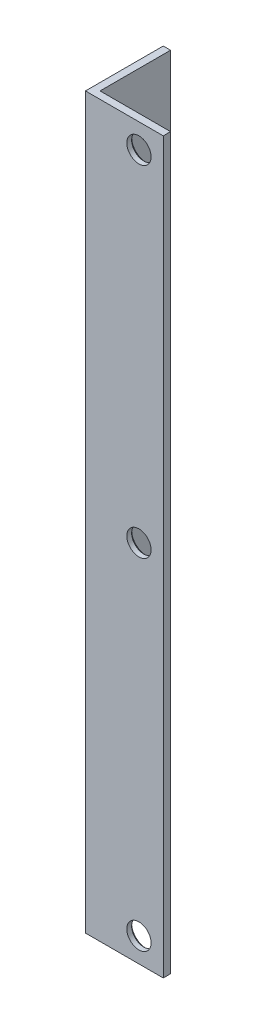
ISO-10303-21;
HEADER;
FILE_DESCRIPTION(('STEP AP214'),'2;1');
FILE_NAME('part.step','',(''),(''),'','','');
FILE_SCHEMA(('AUTOMOTIVE_DESIGN { 1 0 10303 214 1 1 1 1 }'));
ENDSEC;
DATA;
#1=APPLICATION_CONTEXT('core data for automotive mechanical design processes');
#2=APPLICATION_PROTOCOL_DEFINITION('international standard','automotive_design',2000,#1);
#3=PRODUCT_CONTEXT('',#1,'mechanical');
#4=PRODUCT('Part','Part','',(#3));
#5=PRODUCT_RELATED_PRODUCT_CATEGORY('part','',(#4));
#6=PRODUCT_DEFINITION_FORMATION('','',#4);
#7=PRODUCT_DEFINITION_CONTEXT('part definition',#1,'design');
#8=PRODUCT_DEFINITION('design','',#6,#7);
#9=PRODUCT_DEFINITION_SHAPE('','',#8);
#10=(LENGTH_UNIT() NAMED_UNIT(*) SI_UNIT(.MILLI.,.METRE.));
#11=(NAMED_UNIT(*) PLANE_ANGLE_UNIT() SI_UNIT($,.RADIAN.));
#12=(NAMED_UNIT(*) SI_UNIT($,.STERADIAN.) SOLID_ANGLE_UNIT());
#13=UNCERTAINTY_MEASURE_WITH_UNIT(LENGTH_MEASURE(1.E-05),#10,'distance_accuracy_value','');
#14=(GEOMETRIC_REPRESENTATION_CONTEXT(3) GLOBAL_UNCERTAINTY_ASSIGNED_CONTEXT((#13)) GLOBAL_UNIT_ASSIGNED_CONTEXT((#10,
#11,#12)) REPRESENTATION_CONTEXT('',''));
#15=CARTESIAN_POINT('',(0.,0.,0.));
#16=DIRECTION('',(0.,0.,1.));
#17=DIRECTION('',(1.,0.,0.));
#18=AXIS2_PLACEMENT_3D('',#15,#16,#17);
#19=CARTESIAN_POINT('',(0.,300.,0.));
#20=DIRECTION('',(0.,0.,-1.));
#21=DIRECTION('',(-1.,0.,0.));
#22=AXIS2_PLACEMENT_3D('',#19,#20,#21);
#23=PLANE('',#22);
#24=CARTESIAN_POINT('',(22.,10.,0.));
#25=DIRECTION('',(0.,0.,1.));
#26=DIRECTION('',(1.,0.,0.));
#27=AXIS2_PLACEMENT_3D('',#24,#25,#26);
#28=CIRCLE('',#27,5.);
#29=CARTESIAN_POINT('',(27.,10.,0.));
#30=VERTEX_POINT('',#29);
#31=EDGE_CURVE('E123',#30,#30,#28,.T.);
#32=ORIENTED_EDGE('',*,*,#31,.F.);
#33=EDGE_LOOP('',(#32));
#34=FACE_BOUND('',#33,.T.);
#35=CARTESIAN_POINT('',(21.9999999999995,150.,0.));
#36=DIRECTION('',(0.,0.,1.));
#37=DIRECTION('',(1.,0.,0.));
#38=AXIS2_PLACEMENT_3D('',#35,#36,#37);
#39=CIRCLE('',#38,5.);
#40=CARTESIAN_POINT('',(26.9999999999995,150.,0.));
#41=VERTEX_POINT('',#40);
#42=EDGE_CURVE('E212',#41,#41,#39,.T.);
#43=ORIENTED_EDGE('',*,*,#42,.F.);
#44=EDGE_LOOP('',(#43));
#45=FACE_BOUND('',#44,.T.);
#46=CARTESIAN_POINT('',(21.999999999999,290.,0.));
#47=DIRECTION('',(0.,0.,1.));
#48=DIRECTION('',(1.,0.,0.));
#49=AXIS2_PLACEMENT_3D('',#46,#47,#48);
#50=CIRCLE('',#49,5.);
#51=CARTESIAN_POINT('',(26.999999999999,290.,0.));
#52=VERTEX_POINT('',#51);
#53=EDGE_CURVE('E215',#52,#52,#50,.T.);
#54=ORIENTED_EDGE('',*,*,#53,.F.);
#55=EDGE_LOOP('',(#54));
#56=FACE_BOUND('',#55,.T.);
#57=DIRECTION('',(1.,0.,0.));
#58=VECTOR('',#57,1.);
#59=CARTESIAN_POINT('',(0.,0.,0.));
#60=LINE('',#59,#58);
#61=CARTESIAN_POINT('',(0.,0.,0.));
#62=VERTEX_POINT('',#61);
#63=CARTESIAN_POINT('',(32.,0.,0.));
#64=VERTEX_POINT('',#63);
#65=EDGE_CURVE('E119',#62,#64,#60,.T.);
#66=ORIENTED_EDGE('',*,*,#65,.T.);
#67=DIRECTION('',(0.,-1.,0.));
#68=VECTOR('',#67,1.);
#69=CARTESIAN_POINT('',(32.,300.,0.));
#70=LINE('',#69,#68);
#71=CARTESIAN_POINT('',(32.,300.,0.));
#72=VERTEX_POINT('',#71);
#73=EDGE_CURVE('E138',#72,#64,#70,.T.);
#74=ORIENTED_EDGE('',*,*,#73,.F.);
#75=DIRECTION('',(1.,0.,0.));
#76=VECTOR('',#75,1.);
#77=CARTESIAN_POINT('',(0.,300.,0.));
#78=LINE('',#77,#76);
#79=CARTESIAN_POINT('',(0.,300.,0.));
#80=VERTEX_POINT('',#79);
#81=EDGE_CURVE('E84',#80,#72,#78,.T.);
#82=ORIENTED_EDGE('',*,*,#81,.F.);
#83=DIRECTION('',(0.,-1.,0.));
#84=VECTOR('',#83,1.);
#85=CARTESIAN_POINT('',(0.,300.,0.));
#86=LINE('',#85,#84);
#87=EDGE_CURVE('E115',#80,#62,#86,.T.);
#88=ORIENTED_EDGE('',*,*,#87,.T.);
#89=EDGE_LOOP('',(#66,#74,#82,#88));
#90=FACE_BOUND('',#89,.T.);
#91=ADVANCED_FACE('F36',(#34,#45,#56,#90),#23,.F.);
#92=CARTESIAN_POINT('',(32.,300.,-3.));
#93=DIRECTION('',(1.,0.,0.));
#94=DIRECTION('',(0.,0.,-1.));
#95=AXIS2_PLACEMENT_3D('',#92,#93,#94);
#96=PLANE('',#95);
#97=DIRECTION('',(0.,0.,1.));
#98=VECTOR('',#97,1.);
#99=CARTESIAN_POINT('',(32.,0.,-3.));
#100=LINE('',#99,#98);
#101=CARTESIAN_POINT('',(32.,0.,-3.));
#102=VERTEX_POINT('',#101);
#103=EDGE_CURVE('E122',#102,#64,#100,.T.);
#104=ORIENTED_EDGE('',*,*,#103,.F.);
#105=DIRECTION('',(0.,-1.,0.));
#106=VECTOR('',#105,1.);
#107=CARTESIAN_POINT('',(32.,300.,-3.));
#108=LINE('',#107,#106);
#109=CARTESIAN_POINT('',(32.,300.,-3.));
#110=VERTEX_POINT('',#109);
#111=EDGE_CURVE('E136',#110,#102,#108,.T.);
#112=ORIENTED_EDGE('',*,*,#111,.F.);
#113=DIRECTION('',(0.,0.,1.));
#114=VECTOR('',#113,1.);
#115=CARTESIAN_POINT('',(32.,300.,-3.));
#116=LINE('',#115,#114);
#117=EDGE_CURVE('E221',#110,#72,#116,.T.);
#118=ORIENTED_EDGE('',*,*,#117,.T.);
#119=ORIENTED_EDGE('',*,*,#73,.T.);
#120=EDGE_LOOP('',(#104,#112,#118,#119));
#121=FACE_BOUND('',#120,.T.);
#122=ADVANCED_FACE('F171',(#121),#96,.T.);
#123=CARTESIAN_POINT('',(0.,300.,-3.));
#124=DIRECTION('',(0.,0.,-1.));
#125=DIRECTION('',(-1.,0.,0.));
#126=AXIS2_PLACEMENT_3D('',#123,#124,#125);
#127=PLANE('',#126);
#128=CARTESIAN_POINT('',(22.,10.,-3.));
#129=DIRECTION('',(0.,0.,-1.));
#130=DIRECTION('',(-1.,0.,0.));
#131=AXIS2_PLACEMENT_3D('',#128,#129,#130);
#132=CIRCLE('',#131,6.00000000000006);
#133=CARTESIAN_POINT('',(15.9999999999999,10.,-3.));
#134=VERTEX_POINT('',#133);
#135=EDGE_CURVE('E149',#134,#134,#132,.F.);
#136=ORIENTED_EDGE('',*,*,#135,.T.);
#137=EDGE_LOOP('',(#136));
#138=FACE_BOUND('',#137,.T.);
#139=CARTESIAN_POINT('',(21.9999999999995,150.,-3.));
#140=DIRECTION('',(0.,0.,-1.));
#141=DIRECTION('',(-1.,0.,0.));
#142=AXIS2_PLACEMENT_3D('',#139,#140,#141);
#143=CIRCLE('',#142,5.99999999999998);
#144=CARTESIAN_POINT('',(15.9999999999995,150.,-3.));
#145=VERTEX_POINT('',#144);
#146=EDGE_CURVE('E146',#145,#145,#143,.F.);
#147=ORIENTED_EDGE('',*,*,#146,.T.);
#148=EDGE_LOOP('',(#147));
#149=FACE_BOUND('',#148,.T.);
#150=CARTESIAN_POINT('',(21.999999999999,290.,-3.));
#151=DIRECTION('',(0.,0.,-1.));
#152=DIRECTION('',(-1.,0.,0.));
#153=AXIS2_PLACEMENT_3D('',#150,#151,#152);
#154=CIRCLE('',#153,5.99999999999998);
#155=CARTESIAN_POINT('',(15.999999999999,290.,-3.));
#156=VERTEX_POINT('',#155);
#157=EDGE_CURVE('E143',#156,#156,#154,.F.);
#158=ORIENTED_EDGE('',*,*,#157,.T.);
#159=EDGE_LOOP('',(#158));
#160=FACE_BOUND('',#159,.T.);
#161=DIRECTION('',(1.,0.,0.));
#162=VECTOR('',#161,1.);
#163=CARTESIAN_POINT('',(0.,0.,-3.));
#164=LINE('',#163,#162);
#165=CARTESIAN_POINT('',(3.,0.,-3.));
#166=VERTEX_POINT('',#165);
#167=EDGE_CURVE('E126',#166,#102,#164,.T.);
#168=ORIENTED_EDGE('',*,*,#167,.F.);
#169=DIRECTION('',(0.,-1.,0.));
#170=VECTOR('',#169,1.);
#171=CARTESIAN_POINT('',(3.,300.,-3.));
#172=LINE('',#171,#170);
#173=CARTESIAN_POINT('',(3.,300.,-3.));
#174=VERTEX_POINT('',#173);
#175=EDGE_CURVE('E105',#174,#166,#172,.T.);
#176=ORIENTED_EDGE('',*,*,#175,.F.);
#177=DIRECTION('',(1.,0.,0.));
#178=VECTOR('',#177,1.);
#179=CARTESIAN_POINT('',(0.,300.,-3.));
#180=LINE('',#179,#178);
#181=EDGE_CURVE('E111',#174,#110,#180,.T.);
#182=ORIENTED_EDGE('',*,*,#181,.T.);
#183=ORIENTED_EDGE('',*,*,#111,.T.);
#184=EDGE_LOOP('',(#168,#176,#182,#183));
#185=FACE_BOUND('',#184,.T.);
#186=ADVANCED_FACE('F177',(#138,#149,#160,#185),#127,.T.);
#187=CARTESIAN_POINT('',(3.,300.,-32.));
#188=DIRECTION('',(1.,0.,0.));
#189=DIRECTION('',(0.,0.,-1.));
#190=AXIS2_PLACEMENT_3D('',#187,#188,#189);
#191=PLANE('',#190);
#192=DIRECTION('',(0.,0.,1.));
#193=VECTOR('',#192,1.);
#194=CARTESIAN_POINT('',(3.,0.,-32.));
#195=LINE('',#194,#193);
#196=CARTESIAN_POINT('',(3.,0.,-32.));
#197=VERTEX_POINT('',#196);
#198=EDGE_CURVE('E100',#197,#166,#195,.T.);
#199=ORIENTED_EDGE('',*,*,#198,.F.);
#200=DIRECTION('',(0.,-1.,0.));
#201=VECTOR('',#200,1.);
#202=CARTESIAN_POINT('',(3.,300.,-32.));
#203=LINE('',#202,#201);
#204=CARTESIAN_POINT('',(3.,300.,-32.));
#205=VERTEX_POINT('',#204);
#206=EDGE_CURVE('E95',#205,#197,#203,.T.);
#207=ORIENTED_EDGE('',*,*,#206,.F.);
#208=DIRECTION('',(0.,0.,1.));
#209=VECTOR('',#208,1.);
#210=CARTESIAN_POINT('',(3.,300.,-32.));
#211=LINE('',#210,#209);
#212=EDGE_CURVE('E98',#205,#174,#211,.T.);
#213=ORIENTED_EDGE('',*,*,#212,.T.);
#214=ORIENTED_EDGE('',*,*,#175,.T.);
#215=EDGE_LOOP('',(#199,#207,#213,#214));
#216=FACE_BOUND('',#215,.T.);
#217=ADVANCED_FACE('F97',(#216),#191,.T.);
#218=CARTESIAN_POINT('',(0.,300.,-32.));
#219=DIRECTION('',(0.,0.,-1.));
#220=DIRECTION('',(-1.,0.,0.));
#221=AXIS2_PLACEMENT_3D('',#218,#219,#220);
#222=PLANE('',#221);
#223=DIRECTION('',(1.,0.,0.));
#224=VECTOR('',#223,1.);
#225=CARTESIAN_POINT('',(0.,0.,-32.));
#226=LINE('',#225,#224);
#227=CARTESIAN_POINT('',(0.,0.,-32.));
#228=VERTEX_POINT('',#227);
#229=EDGE_CURVE('E130',#228,#197,#226,.T.);
#230=ORIENTED_EDGE('',*,*,#229,.F.);
#231=DIRECTION('',(0.,-1.,0.));
#232=VECTOR('',#231,1.);
#233=CARTESIAN_POINT('',(0.,300.,-32.));
#234=LINE('',#233,#232);
#235=CARTESIAN_POINT('',(0.,300.,-32.));
#236=VERTEX_POINT('',#235);
#237=EDGE_CURVE('E75',#236,#228,#234,.T.);
#238=ORIENTED_EDGE('',*,*,#237,.F.);
#239=DIRECTION('',(1.,0.,0.));
#240=VECTOR('',#239,1.);
#241=CARTESIAN_POINT('',(0.,300.,-32.));
#242=LINE('',#241,#240);
#243=EDGE_CURVE('E109',#236,#205,#242,.T.);
#244=ORIENTED_EDGE('',*,*,#243,.T.);
#245=ORIENTED_EDGE('',*,*,#206,.T.);
#246=EDGE_LOOP('',(#230,#238,#244,#245));
#247=FACE_BOUND('',#246,.T.);
#248=ADVANCED_FACE('F113',(#247),#222,.T.);
#249=CARTESIAN_POINT('',(0.,300.,-32.));
#250=DIRECTION('',(1.,0.,0.));
#251=DIRECTION('',(0.,0.,-1.));
#252=AXIS2_PLACEMENT_3D('',#249,#250,#251);
#253=PLANE('',#252);
#254=DIRECTION('',(0.,0.,1.));
#255=VECTOR('',#254,1.);
#256=CARTESIAN_POINT('',(0.,0.,-32.));
#257=LINE('',#256,#255);
#258=EDGE_CURVE('E78',#228,#62,#257,.T.);
#259=ORIENTED_EDGE('',*,*,#258,.T.);
#260=ORIENTED_EDGE('',*,*,#87,.F.);
#261=DIRECTION('',(0.,0.,1.));
#262=VECTOR('',#261,1.);
#263=CARTESIAN_POINT('',(0.,300.,-32.));
#264=LINE('',#263,#262);
#265=EDGE_CURVE('E53',#236,#80,#264,.T.);
#266=ORIENTED_EDGE('',*,*,#265,.F.);
#267=ORIENTED_EDGE('',*,*,#237,.T.);
#268=EDGE_LOOP('',(#259,#260,#266,#267));
#269=FACE_BOUND('',#268,.T.);
#270=ADVANCED_FACE('F190',(#269),#253,.F.);
#271=CARTESIAN_POINT('',(0.,300.,0.));
#272=DIRECTION('',(0.,-1.,0.));
#273=DIRECTION('',(-1.,0.,0.));
#274=AXIS2_PLACEMENT_3D('',#271,#272,#273);
#275=PLANE('',#274);
#276=ORIENTED_EDGE('',*,*,#81,.T.);
#277=ORIENTED_EDGE('',*,*,#117,.F.);
#278=ORIENTED_EDGE('',*,*,#181,.F.);
#279=ORIENTED_EDGE('',*,*,#212,.F.);
#280=ORIENTED_EDGE('',*,*,#243,.F.);
#281=ORIENTED_EDGE('',*,*,#265,.T.);
#282=EDGE_LOOP('',(#276,#277,#278,#279,#280,#281));
#283=FACE_BOUND('',#282,.T.);
#284=ADVANCED_FACE('F108',(#283),#275,.F.);
#285=CARTESIAN_POINT('',(0.,0.,0.));
#286=DIRECTION('',(0.,-1.,0.));
#287=DIRECTION('',(-1.,0.,0.));
#288=AXIS2_PLACEMENT_3D('',#285,#286,#287);
#289=PLANE('',#288);
#290=ORIENTED_EDGE('',*,*,#65,.F.);
#291=ORIENTED_EDGE('',*,*,#258,.F.);
#292=ORIENTED_EDGE('',*,*,#229,.T.);
#293=ORIENTED_EDGE('',*,*,#198,.T.);
#294=ORIENTED_EDGE('',*,*,#167,.T.);
#295=ORIENTED_EDGE('',*,*,#103,.T.);
#296=EDGE_LOOP('',(#290,#291,#292,#293,#294,#295));
#297=FACE_BOUND('',#296,.T.);
#298=ADVANCED_FACE('F193',(#297),#289,.T.);
#299=CARTESIAN_POINT('',(21.999999999999,290.,-32.));
#300=DIRECTION('',(0.,0.,1.));
#301=DIRECTION('',(1.,0.,0.));
#302=AXIS2_PLACEMENT_3D('',#299,#300,#301);
#303=CYLINDRICAL_SURFACE('',#302,5.);
#304=CARTESIAN_POINT('',(21.999999999999,290.,-2.00000000000003));
#305=DIRECTION('',(0.,0.,-1.));
#306=DIRECTION('',(-1.,0.,0.));
#307=AXIS2_PLACEMENT_3D('',#304,#305,#306);
#308=CIRCLE('',#307,5.);
#309=CARTESIAN_POINT('',(16.999999999999,290.,-2.00000000000003));
#310=VERTEX_POINT('',#309);
#311=EDGE_CURVE('E11',#310,#310,#308,.T.);
#312=ORIENTED_EDGE('',*,*,#311,.T.);
#313=EDGE_LOOP('',(#312));
#314=FACE_BOUND('',#313,.T.);
#315=ORIENTED_EDGE('',*,*,#53,.T.);
#316=EDGE_LOOP('',(#315));
#317=FACE_BOUND('',#316,.T.);
#318=ADVANCED_FACE('F196',(#314,#317),#303,.F.);
#319=CARTESIAN_POINT('',(21.9999999999995,150.,-32.));
#320=DIRECTION('',(0.,0.,1.));
#321=DIRECTION('',(1.,0.,0.));
#322=AXIS2_PLACEMENT_3D('',#319,#320,#321);
#323=CYLINDRICAL_SURFACE('',#322,5.);
#324=CARTESIAN_POINT('',(21.9999999999995,150.,-2.00000000000003));
#325=DIRECTION('',(0.,0.,-1.));
#326=DIRECTION('',(-1.,0.,0.));
#327=AXIS2_PLACEMENT_3D('',#324,#325,#326);
#328=CIRCLE('',#327,5.);
#329=CARTESIAN_POINT('',(16.9999999999995,150.,-2.00000000000003));
#330=VERTEX_POINT('',#329);
#331=EDGE_CURVE('E45',#330,#330,#328,.T.);
#332=ORIENTED_EDGE('',*,*,#331,.T.);
#333=EDGE_LOOP('',(#332));
#334=FACE_BOUND('',#333,.T.);
#335=ORIENTED_EDGE('',*,*,#42,.T.);
#336=EDGE_LOOP('',(#335));
#337=FACE_BOUND('',#336,.T.);
#338=ADVANCED_FACE('F154',(#334,#337),#323,.F.);
#339=CARTESIAN_POINT('',(22.,10.,-32.));
#340=DIRECTION('',(0.,0.,1.));
#341=DIRECTION('',(1.,0.,0.));
#342=AXIS2_PLACEMENT_3D('',#339,#340,#341);
#343=CYLINDRICAL_SURFACE('',#342,5.);
#344=CARTESIAN_POINT('',(22.,10.,-1.99999999999992));
#345=DIRECTION('',(0.,0.,-1.));
#346=DIRECTION('',(-1.,0.,0.));
#347=AXIS2_PLACEMENT_3D('',#344,#345,#346);
#348=CIRCLE('',#347,5.);
#349=CARTESIAN_POINT('',(17.,10.,-1.99999999999992));
#350=VERTEX_POINT('',#349);
#351=EDGE_CURVE('E140',#350,#350,#348,.T.);
#352=ORIENTED_EDGE('',*,*,#351,.T.);
#353=EDGE_LOOP('',(#352));
#354=FACE_BOUND('',#353,.T.);
#355=ORIENTED_EDGE('',*,*,#31,.T.);
#356=EDGE_LOOP('',(#355));
#357=FACE_BOUND('',#356,.T.);
#358=ADVANCED_FACE('F166',(#354,#357),#343,.F.);
#359=CARTESIAN_POINT('',(22.,10.,-1.99999999999992));
#360=DIRECTION('',(0.,0.,-1.));
#361=DIRECTION('',(-1.,0.,0.));
#362=AXIS2_PLACEMENT_3D('',#359,#360,#361);
#363=CONICAL_SURFACE('',#362,5.,0.78539816339744);
#364=ORIENTED_EDGE('',*,*,#135,.F.);
#365=EDGE_LOOP('',(#364));
#366=FACE_BOUND('',#365,.T.);
#367=ORIENTED_EDGE('',*,*,#351,.F.);
#368=EDGE_LOOP('',(#367));
#369=FACE_BOUND('',#368,.T.);
#370=ADVANCED_FACE('F159',(#366,#369),#363,.F.);
#371=CARTESIAN_POINT('',(21.9999999999995,150.,-2.00000000000003));
#372=DIRECTION('',(0.,0.,-1.));
#373=DIRECTION('',(-1.,0.,0.));
#374=AXIS2_PLACEMENT_3D('',#371,#372,#373);
#375=CONICAL_SURFACE('',#374,5.,0.785398163397453);
#376=ORIENTED_EDGE('',*,*,#146,.F.);
#377=EDGE_LOOP('',(#376));
#378=FACE_BOUND('',#377,.T.);
#379=ORIENTED_EDGE('',*,*,#331,.F.);
#380=EDGE_LOOP('',(#379));
#381=FACE_BOUND('',#380,.T.);
#382=ADVANCED_FACE('F157',(#378,#381),#375,.F.);
#383=CARTESIAN_POINT('',(21.999999999999,290.,-2.00000000000003));
#384=DIRECTION('',(0.,0.,-1.));
#385=DIRECTION('',(-1.,0.,0.));
#386=AXIS2_PLACEMENT_3D('',#383,#384,#385);
#387=CONICAL_SURFACE('',#386,5.,0.785398163397453);
#388=ORIENTED_EDGE('',*,*,#157,.F.);
#389=EDGE_LOOP('',(#388));
#390=FACE_BOUND('',#389,.T.);
#391=ORIENTED_EDGE('',*,*,#311,.F.);
#392=EDGE_LOOP('',(#391));
#393=FACE_BOUND('',#392,.T.);
#394=ADVANCED_FACE('F38',(#390,#393),#387,.F.);
#395=CLOSED_SHELL('',(#91,#122,#186,#217,#248,#270,#284,#298,#318,#338,#358,#370,#382,#394));
#396=MANIFOLD_SOLID_BREP('B2',#395);
#397=ADVANCED_BREP_SHAPE_REPRESENTATION('',(#18,#396),#14);
#398=SHAPE_DEFINITION_REPRESENTATION(#9,#397);
ENDSEC;
END-ISO-10303-21;
